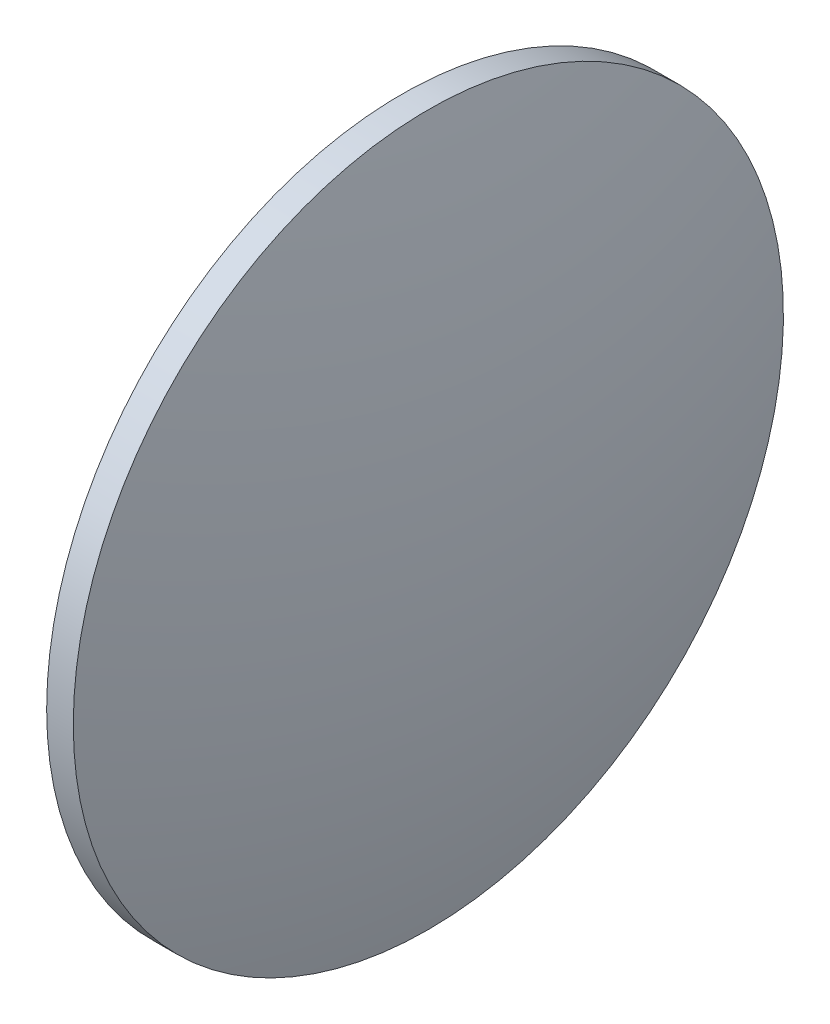
ISO-10303-21;
HEADER;
FILE_DESCRIPTION(('STEP AP214'),'2;1');
FILE_NAME('part.step','',(''),(''),'','','');
FILE_SCHEMA(('AUTOMOTIVE_DESIGN { 1 0 10303 214 1 1 1 1 }'));
ENDSEC;
DATA;
#1=APPLICATION_CONTEXT('core data for automotive mechanical design processes');
#2=APPLICATION_PROTOCOL_DEFINITION('international standard','automotive_design',2000,#1);
#3=PRODUCT_CONTEXT('',#1,'mechanical');
#4=PRODUCT('Part','Part','',(#3));
#5=PRODUCT_RELATED_PRODUCT_CATEGORY('part','',(#4));
#6=PRODUCT_DEFINITION_FORMATION('','',#4);
#7=PRODUCT_DEFINITION_CONTEXT('part definition',#1,'design');
#8=PRODUCT_DEFINITION('design','',#6,#7);
#9=PRODUCT_DEFINITION_SHAPE('','',#8);
#10=(LENGTH_UNIT() NAMED_UNIT(*) SI_UNIT(.MILLI.,.METRE.));
#11=(NAMED_UNIT(*) PLANE_ANGLE_UNIT() SI_UNIT($,.RADIAN.));
#12=(NAMED_UNIT(*) SI_UNIT($,.STERADIAN.) SOLID_ANGLE_UNIT());
#13=UNCERTAINTY_MEASURE_WITH_UNIT(LENGTH_MEASURE(1.E-05),#10,'distance_accuracy_value','');
#14=(GEOMETRIC_REPRESENTATION_CONTEXT(3) GLOBAL_UNCERTAINTY_ASSIGNED_CONTEXT((#13)) GLOBAL_UNIT_ASSIGNED_CONTEXT((#10,
#11,#12)) REPRESENTATION_CONTEXT('',''));
#15=CARTESIAN_POINT('',(0.,0.,0.));
#16=DIRECTION('',(0.,0.,1.));
#17=DIRECTION('',(1.,0.,0.));
#18=AXIS2_PLACEMENT_3D('',#15,#16,#17);
#19=CARTESIAN_POINT('',(640.026261001272,121.191629625519,0.));
#20=DIRECTION('',(-1.,0.,0.));
#21=DIRECTION('',(0.,-1.,0.));
#22=AXIS2_PLACEMENT_3D('',#19,#20,#21);
#23=SPHERICAL_SURFACE('',#22,155.000754346277);
#24=CARTESIAN_POINT('',(789.776833113418,121.191629625519,0.));
#25=DIRECTION('',(-1.,0.,0.));
#26=DIRECTION('',(0.,0.,1.));
#27=AXIS2_PLACEMENT_3D('',#24,#25,#26);
#28=CIRCLE('',#27,40.);
#29=CARTESIAN_POINT('',(789.776833113418,121.191629625519,40.));
#30=VERTEX_POINT('',#29);
#31=EDGE_CURVE('E10',#30,#30,#28,.T.);
#32=ORIENTED_EDGE('',*,*,#31,.F.);
#33=EDGE_LOOP('',(#32));
#34=FACE_BOUND('',#33,.T.);
#35=ADVANCED_FACE('F33',(#34),#23,.T.);
#36=CARTESIAN_POINT('',(767.951855435845,121.191629625519,0.));
#37=DIRECTION('',(-1.,0.,0.));
#38=DIRECTION('',(0.,0.,1.));
#39=AXIS2_PLACEMENT_3D('',#36,#37,#38);
#40=CYLINDRICAL_SURFACE('',#39,40.);
#41=CARTESIAN_POINT('',(786.776833113418,121.191629625519,0.));
#42=DIRECTION('',(-1.,0.,0.));
#43=DIRECTION('',(0.,0.,1.));
#44=AXIS2_PLACEMENT_3D('',#41,#42,#43);
#45=CIRCLE('',#44,40.);
#46=CARTESIAN_POINT('',(786.776833113418,121.191629625519,40.));
#47=VERTEX_POINT('',#46);
#48=EDGE_CURVE('E39',#47,#47,#45,.T.);
#49=ORIENTED_EDGE('',*,*,#48,.F.);
#50=EDGE_LOOP('',(#49));
#51=FACE_BOUND('',#50,.T.);
#52=ORIENTED_EDGE('',*,*,#31,.T.);
#53=EDGE_LOOP('',(#52));
#54=FACE_BOUND('',#53,.T.);
#55=ADVANCED_FACE('F47',(#51,#54),#40,.T.);
#56=CARTESIAN_POINT('',(786.776833113418,121.191629625519,0.));
#57=DIRECTION('',(1.,0.,0.));
#58=DIRECTION('',(0.,0.,-1.));
#59=AXIS2_PLACEMENT_3D('',#56,#57,#58);
#60=PLANE('',#59);
#61=ORIENTED_EDGE('',*,*,#48,.T.);
#62=EDGE_LOOP('',(#61));
#63=FACE_BOUND('',#62,.T.);
#64=ADVANCED_FACE('F45',(#63),#60,.F.);
#65=CLOSED_SHELL('',(#35,#55,#64));
#66=MANIFOLD_SOLID_BREP('B2',#65);
#67=ADVANCED_BREP_SHAPE_REPRESENTATION('',(#18,#66),#14);
#68=SHAPE_DEFINITION_REPRESENTATION(#9,#67);
ENDSEC;
END-ISO-10303-21;
